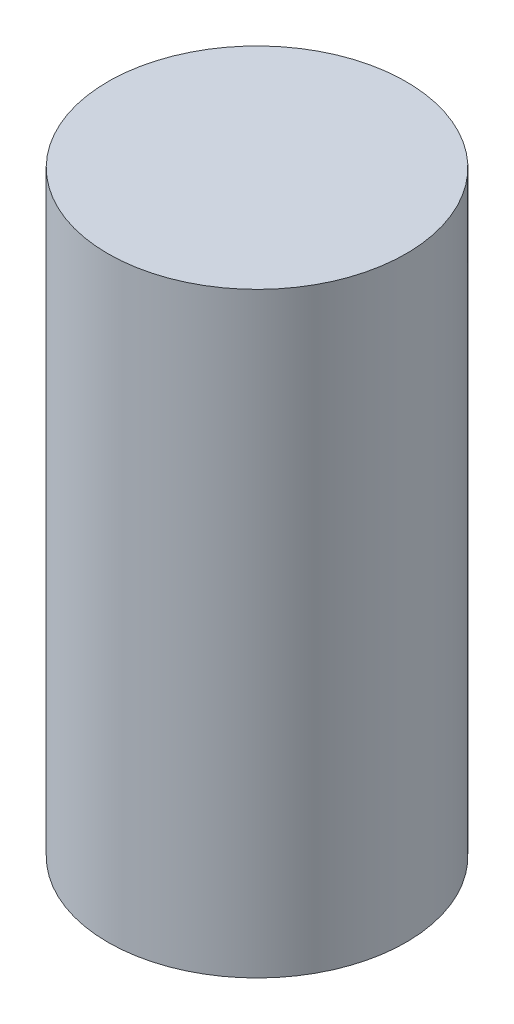
ISO-10303-21;
HEADER;
FILE_DESCRIPTION(('STEP AP214'),'2;1');
FILE_NAME('part.step','',(''),(''),'','','');
FILE_SCHEMA(('AUTOMOTIVE_DESIGN { 1 0 10303 214 1 1 1 1 }'));
ENDSEC;
DATA;
#1=APPLICATION_CONTEXT('core data for automotive mechanical design processes');
#2=APPLICATION_PROTOCOL_DEFINITION('international standard','automotive_design',2000,#1);
#3=PRODUCT_CONTEXT('',#1,'mechanical');
#4=PRODUCT('Part','Part','',(#3));
#5=PRODUCT_RELATED_PRODUCT_CATEGORY('part','',(#4));
#6=PRODUCT_DEFINITION_FORMATION('','',#4);
#7=PRODUCT_DEFINITION_CONTEXT('part definition',#1,'design');
#8=PRODUCT_DEFINITION('design','',#6,#7);
#9=PRODUCT_DEFINITION_SHAPE('','',#8);
#10=(LENGTH_UNIT() NAMED_UNIT(*) SI_UNIT(.MILLI.,.METRE.));
#11=(NAMED_UNIT(*) PLANE_ANGLE_UNIT() SI_UNIT($,.RADIAN.));
#12=(NAMED_UNIT(*) SI_UNIT($,.STERADIAN.) SOLID_ANGLE_UNIT());
#13=UNCERTAINTY_MEASURE_WITH_UNIT(LENGTH_MEASURE(1.E-05),#10,'distance_accuracy_value','');
#14=(GEOMETRIC_REPRESENTATION_CONTEXT(3) GLOBAL_UNCERTAINTY_ASSIGNED_CONTEXT((#13)) GLOBAL_UNIT_ASSIGNED_CONTEXT((#10,
#11,#12)) REPRESENTATION_CONTEXT('',''));
#15=CARTESIAN_POINT('',(0.,0.,0.));
#16=DIRECTION('',(0.,0.,1.));
#17=DIRECTION('',(1.,0.,0.));
#18=AXIS2_PLACEMENT_3D('',#15,#16,#17);
#19=CARTESIAN_POINT('',(0.,40.,0.));
#20=DIRECTION('',(0.,-1.,0.));
#21=DIRECTION('',(0.,0.,-1.));
#22=AXIS2_PLACEMENT_3D('',#19,#20,#21);
#23=CYLINDRICAL_SURFACE('',#22,10.);
#24=CARTESIAN_POINT('',(0.,40.,0.));
#25=DIRECTION('',(0.,1.,0.));
#26=DIRECTION('',(0.,0.,1.));
#27=AXIS2_PLACEMENT_3D('',#24,#25,#26);
#28=CIRCLE('',#27,10.);
#29=CARTESIAN_POINT('',(0.,40.,10.));
#30=VERTEX_POINT('',#29);
#31=EDGE_CURVE('E10',#30,#30,#28,.T.);
#32=ORIENTED_EDGE('',*,*,#31,.F.);
#33=EDGE_LOOP('',(#32));
#34=FACE_BOUND('',#33,.T.);
#35=CARTESIAN_POINT('',(0.,0.,0.));
#36=DIRECTION('',(0.,1.,0.));
#37=DIRECTION('',(0.,0.,1.));
#38=AXIS2_PLACEMENT_3D('',#35,#36,#37);
#39=CIRCLE('',#38,10.);
#40=CARTESIAN_POINT('',(0.,0.,10.));
#41=VERTEX_POINT('',#40);
#42=EDGE_CURVE('E40',#41,#41,#39,.T.);
#43=ORIENTED_EDGE('',*,*,#42,.T.);
#44=EDGE_LOOP('',(#43));
#45=FACE_BOUND('',#44,.T.);
#46=ADVANCED_FACE('F37',(#34,#45),#23,.T.);
#47=CARTESIAN_POINT('',(0.,40.,0.));
#48=DIRECTION('',(0.,1.,0.));
#49=DIRECTION('',(0.,0.,1.));
#50=AXIS2_PLACEMENT_3D('',#47,#48,#49);
#51=PLANE('',#50);
#52=ORIENTED_EDGE('',*,*,#31,.T.);
#53=EDGE_LOOP('',(#52));
#54=FACE_BOUND('',#53,.T.);
#55=ADVANCED_FACE('F54',(#54),#51,.T.);
#56=CARTESIAN_POINT('',(0.,0.,0.));
#57=DIRECTION('',(0.,1.,0.));
#58=DIRECTION('',(0.,0.,1.));
#59=AXIS2_PLACEMENT_3D('',#56,#57,#58);
#60=PLANE('',#59);
#61=ORIENTED_EDGE('',*,*,#42,.F.);
#62=EDGE_LOOP('',(#61));
#63=FACE_BOUND('',#62,.T.);
#64=ADVANCED_FACE('F52',(#63),#60,.F.);
#65=CLOSED_SHELL('',(#46,#55,#64));
#66=MANIFOLD_SOLID_BREP('B2',#65);
#67=ADVANCED_BREP_SHAPE_REPRESENTATION('',(#18,#66),#14);
#68=SHAPE_DEFINITION_REPRESENTATION(#9,#67);
ENDSEC;
END-ISO-10303-21;
